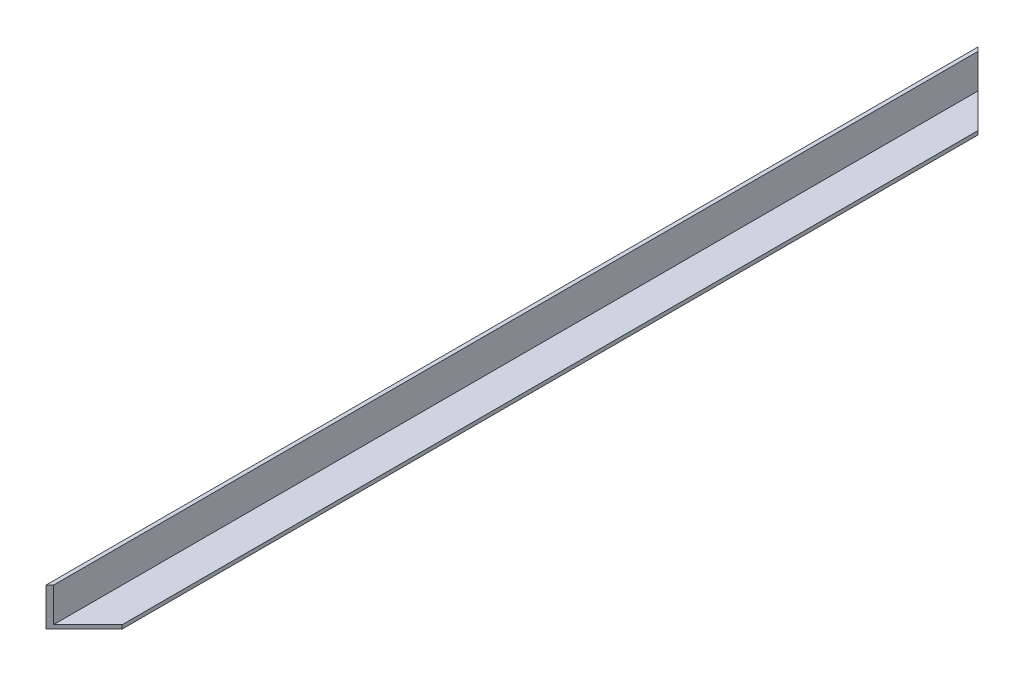
ISO-10303-21;
HEADER;
FILE_DESCRIPTION(('STEP AP214'),'2;1');
FILE_NAME('part.step','',(''),(''),'','','');
FILE_SCHEMA(('AUTOMOTIVE_DESIGN { 1 0 10303 214 1 1 1 1 }'));
ENDSEC;
DATA;
#1=APPLICATION_CONTEXT('core data for automotive mechanical design processes');
#2=APPLICATION_PROTOCOL_DEFINITION('international standard','automotive_design',2000,#1);
#3=PRODUCT_CONTEXT('',#1,'mechanical');
#4=PRODUCT('Part','Part','',(#3));
#5=PRODUCT_RELATED_PRODUCT_CATEGORY('part','',(#4));
#6=PRODUCT_DEFINITION_FORMATION('','',#4);
#7=PRODUCT_DEFINITION_CONTEXT('part definition',#1,'design');
#8=PRODUCT_DEFINITION('design','',#6,#7);
#9=PRODUCT_DEFINITION_SHAPE('','',#8);
#10=(LENGTH_UNIT() NAMED_UNIT(*) SI_UNIT(.MILLI.,.METRE.));
#11=(NAMED_UNIT(*) PLANE_ANGLE_UNIT() SI_UNIT($,.RADIAN.));
#12=(NAMED_UNIT(*) SI_UNIT($,.STERADIAN.) SOLID_ANGLE_UNIT());
#13=UNCERTAINTY_MEASURE_WITH_UNIT(LENGTH_MEASURE(1.E-05),#10,'distance_accuracy_value','');
#14=(GEOMETRIC_REPRESENTATION_CONTEXT(3) GLOBAL_UNCERTAINTY_ASSIGNED_CONTEXT((#13)) GLOBAL_UNIT_ASSIGNED_CONTEXT((#10,
#11,#12)) REPRESENTATION_CONTEXT('',''));
#15=CARTESIAN_POINT('',(0.,0.,0.));
#16=DIRECTION('',(0.,0.,1.));
#17=DIRECTION('',(1.,0.,0.));
#18=AXIS2_PLACEMENT_3D('',#15,#16,#17);
#19=CARTESIAN_POINT('',(2.,20.,489.));
#20=DIRECTION('',(0.,-1.,0.));
#21=DIRECTION('',(0.,0.,-1.));
#22=AXIS2_PLACEMENT_3D('',#19,#20,#21);
#23=PLANE('',#22);
#24=DIRECTION('',(0.,0.,-1.));
#25=VECTOR('',#24,1.);
#26=CARTESIAN_POINT('',(2.,20.,489.));
#27=LINE('',#26,#25);
#28=CARTESIAN_POINT('',(2.00000000000001,20.,487.));
#29=VERTEX_POINT('',#28);
#30=CARTESIAN_POINT('',(1.99999999999999,20.,1.99999999999994));
#31=VERTEX_POINT('',#30);
#32=EDGE_CURVE('E100',#29,#31,#27,.T.);
#33=ORIENTED_EDGE('',*,*,#32,.T.);
#34=DIRECTION('',(0.707106781186555,0.,0.70710678118654));
#35=VECTOR('',#34,1.);
#36=CARTESIAN_POINT('',(0.,20.,0.));
#37=LINE('',#36,#35);
#38=CARTESIAN_POINT('',(0.,20.,0.));
#39=VERTEX_POINT('',#38);
#40=EDGE_CURVE('E86',#39,#31,#37,.T.);
#41=ORIENTED_EDGE('',*,*,#40,.F.);
#42=DIRECTION('',(0.,0.,-1.));
#43=VECTOR('',#42,1.);
#44=CARTESIAN_POINT('',(0.,20.,489.));
#45=LINE('',#44,#43);
#46=CARTESIAN_POINT('',(0.,20.,489.));
#47=VERTEX_POINT('',#46);
#48=EDGE_CURVE('E11',#47,#39,#45,.T.);
#49=ORIENTED_EDGE('',*,*,#48,.F.);
#50=DIRECTION('',(0.707106781186551,0.,-0.707106781186544));
#51=VECTOR('',#50,1.);
#52=CARTESIAN_POINT('',(244.5,20.,244.500000000003));
#53=LINE('',#52,#51);
#54=EDGE_CURVE('E50',#47,#29,#53,.T.);
#55=ORIENTED_EDGE('',*,*,#54,.T.);
#56=EDGE_LOOP('',(#33,#41,#49,#55));
#57=FACE_BOUND('',#56,.T.);
#58=ADVANCED_FACE('F36',(#57),#23,.F.);
#59=CARTESIAN_POINT('',(0.,0.,489.));
#60=DIRECTION('',(0.,1.,0.));
#61=DIRECTION('',(0.,0.,1.));
#62=AXIS2_PLACEMENT_3D('',#59,#60,#61);
#63=PLANE('',#62);
#64=DIRECTION('',(0.,0.,-1.));
#65=VECTOR('',#64,1.);
#66=CARTESIAN_POINT('',(0.,0.,489.));
#67=LINE('',#66,#65);
#68=CARTESIAN_POINT('',(0.,0.,489.));
#69=VERTEX_POINT('',#68);
#70=CARTESIAN_POINT('',(0.,0.,0.));
#71=VERTEX_POINT('',#70);
#72=EDGE_CURVE('E44',#69,#71,#67,.T.);
#73=ORIENTED_EDGE('',*,*,#72,.T.);
#74=DIRECTION('',(0.707106781186555,0.,0.70710678118654));
#75=VECTOR('',#74,1.);
#76=CARTESIAN_POINT('',(244.5,0.,244.499999999995));
#77=LINE('',#76,#75);
#78=CARTESIAN_POINT('',(20.,0.,19.9999999999996));
#79=VERTEX_POINT('',#78);
#80=EDGE_CURVE('E89',#71,#79,#77,.T.);
#81=ORIENTED_EDGE('',*,*,#80,.T.);
#82=DIRECTION('',(0.,0.,-1.));
#83=VECTOR('',#82,1.);
#84=CARTESIAN_POINT('',(20.,0.,489.));
#85=LINE('',#84,#83);
#86=CARTESIAN_POINT('',(20.,0.,469.));
#87=VERTEX_POINT('',#86);
#88=EDGE_CURVE('E117',#87,#79,#85,.T.);
#89=ORIENTED_EDGE('',*,*,#88,.F.);
#90=DIRECTION('',(0.707106781186551,0.,-0.707106781186544));
#91=VECTOR('',#90,1.);
#92=CARTESIAN_POINT('',(0.,0.,489.));
#93=LINE('',#92,#91);
#94=EDGE_CURVE('E94',#69,#87,#93,.T.);
#95=ORIENTED_EDGE('',*,*,#94,.F.);
#96=EDGE_LOOP('',(#73,#81,#89,#95));
#97=FACE_BOUND('',#96,.T.);
#98=ADVANCED_FACE('F120',(#97),#63,.F.);
#99=CARTESIAN_POINT('',(20.,0.,489.));
#100=DIRECTION('',(-1.,0.,0.));
#101=DIRECTION('',(0.,0.,1.));
#102=AXIS2_PLACEMENT_3D('',#99,#100,#101);
#103=PLANE('',#102);
#104=ORIENTED_EDGE('',*,*,#88,.T.);
#105=DIRECTION('',(0.,1.,0.));
#106=VECTOR('',#105,1.);
#107=CARTESIAN_POINT('',(20.,-465.,19.9999999999996));
#108=LINE('',#107,#106);
#109=CARTESIAN_POINT('',(20.,2.,19.9999999999996));
#110=VERTEX_POINT('',#109);
#111=EDGE_CURVE('E101',#79,#110,#108,.T.);
#112=ORIENTED_EDGE('',*,*,#111,.T.);
#113=DIRECTION('',(0.,0.,-1.));
#114=VECTOR('',#113,1.);
#115=CARTESIAN_POINT('',(20.,2.,489.));
#116=LINE('',#115,#114);
#117=CARTESIAN_POINT('',(20.,2.,469.));
#118=VERTEX_POINT('',#117);
#119=EDGE_CURVE('E114',#118,#110,#116,.T.);
#120=ORIENTED_EDGE('',*,*,#119,.F.);
#121=DIRECTION('',(0.,1.,0.));
#122=VECTOR('',#121,1.);
#123=CARTESIAN_POINT('',(20.,-465.,469.));
#124=LINE('',#123,#122);
#125=EDGE_CURVE('E102',#87,#118,#124,.T.);
#126=ORIENTED_EDGE('',*,*,#125,.F.);
#127=EDGE_LOOP('',(#104,#112,#120,#126));
#128=FACE_BOUND('',#127,.T.);
#129=ADVANCED_FACE('F140',(#128),#103,.F.);
#130=CARTESIAN_POINT('',(20.,2.,489.));
#131=DIRECTION('',(0.,-1.,0.));
#132=DIRECTION('',(1.,0.,0.));
#133=AXIS2_PLACEMENT_3D('',#130,#131,#132);
#134=PLANE('',#133);
#135=ORIENTED_EDGE('',*,*,#119,.T.);
#136=DIRECTION('',(-0.707106781186555,0.,-0.70710678118654));
#137=VECTOR('',#136,1.);
#138=CARTESIAN_POINT('',(254.5,2.00000000000003,254.499999999995));
#139=LINE('',#138,#137);
#140=CARTESIAN_POINT('',(2.,2.,2.));
#141=VERTEX_POINT('',#140);
#142=EDGE_CURVE('E130',#110,#141,#139,.T.);
#143=ORIENTED_EDGE('',*,*,#142,.T.);
#144=DIRECTION('',(0.,0.,-1.));
#145=VECTOR('',#144,1.);
#146=CARTESIAN_POINT('',(2.,2.,489.));
#147=LINE('',#146,#145);
#148=CARTESIAN_POINT('',(2.,2.,487.));
#149=VERTEX_POINT('',#148);
#150=EDGE_CURVE('E107',#149,#141,#147,.T.);
#151=ORIENTED_EDGE('',*,*,#150,.F.);
#152=DIRECTION('',(-0.707106781186551,0.,0.707106781186544));
#153=VECTOR('',#152,1.);
#154=CARTESIAN_POINT('',(10.0000000000001,2.,479.));
#155=LINE('',#154,#153);
#156=EDGE_CURVE('E123',#118,#149,#155,.T.);
#157=ORIENTED_EDGE('',*,*,#156,.F.);
#158=EDGE_LOOP('',(#135,#143,#151,#157));
#159=FACE_BOUND('',#158,.T.);
#160=ADVANCED_FACE('F142',(#159),#134,.F.);
#161=CARTESIAN_POINT('',(2.,2.,489.));
#162=DIRECTION('',(-1.,0.,0.));
#163=DIRECTION('',(0.,-1.,0.));
#164=AXIS2_PLACEMENT_3D('',#161,#162,#163);
#165=PLANE('',#164);
#166=ORIENTED_EDGE('',*,*,#150,.T.);
#167=DIRECTION('',(0.,1.,0.));
#168=VECTOR('',#167,1.);
#169=CARTESIAN_POINT('',(2.,2.00000000000004,2.));
#170=LINE('',#169,#168);
#171=EDGE_CURVE('E133',#141,#31,#170,.T.);
#172=ORIENTED_EDGE('',*,*,#171,.T.);
#173=ORIENTED_EDGE('',*,*,#32,.F.);
#174=DIRECTION('',(0.,1.,0.));
#175=VECTOR('',#174,1.);
#176=CARTESIAN_POINT('',(2.,2.,487.));
#177=LINE('',#176,#175);
#178=EDGE_CURVE('E124',#149,#29,#177,.T.);
#179=ORIENTED_EDGE('',*,*,#178,.F.);
#180=EDGE_LOOP('',(#166,#172,#173,#179));
#181=FACE_BOUND('',#180,.T.);
#182=ADVANCED_FACE('F145',(#181),#165,.F.);
#183=CARTESIAN_POINT('',(0.,20.,489.));
#184=DIRECTION('',(1.,0.,0.));
#185=DIRECTION('',(0.,1.,0.));
#186=AXIS2_PLACEMENT_3D('',#183,#184,#185);
#187=PLANE('',#186);
#188=DIRECTION('',(0.,-1.,0.));
#189=VECTOR('',#188,1.);
#190=CARTESIAN_POINT('',(0.,20.,0.));
#191=LINE('',#190,#189);
#192=EDGE_CURVE('E83',#39,#71,#191,.T.);
#193=ORIENTED_EDGE('',*,*,#192,.T.);
#194=ORIENTED_EDGE('',*,*,#72,.F.);
#195=DIRECTION('',(0.,-1.,0.));
#196=VECTOR('',#195,1.);
#197=CARTESIAN_POINT('',(0.,20.,489.));
#198=LINE('',#197,#196);
#199=EDGE_CURVE('E93',#47,#69,#198,.T.);
#200=ORIENTED_EDGE('',*,*,#199,.F.);
#201=ORIENTED_EDGE('',*,*,#48,.T.);
#202=EDGE_LOOP('',(#193,#194,#200,#201));
#203=FACE_BOUND('',#202,.T.);
#204=ADVANCED_FACE('F104',(#203),#187,.F.);
#205=CARTESIAN_POINT('',(0.,-465.,0.));
#206=DIRECTION('',(-0.70710678118654,0.,0.707106781186555));
#207=DIRECTION('',(0.707106781186555,0.,0.70710678118654));
#208=AXIS2_PLACEMENT_3D('',#205,#206,#207);
#209=PLANE('',#208);
#210=ORIENTED_EDGE('',*,*,#192,.F.);
#211=ORIENTED_EDGE('',*,*,#40,.T.);
#212=ORIENTED_EDGE('',*,*,#171,.F.);
#213=ORIENTED_EDGE('',*,*,#142,.F.);
#214=ORIENTED_EDGE('',*,*,#111,.F.);
#215=ORIENTED_EDGE('',*,*,#80,.F.);
#216=EDGE_LOOP('',(#210,#211,#212,#213,#214,#215));
#217=FACE_BOUND('',#216,.T.);
#218=ADVANCED_FACE('F85',(#217),#209,.F.);
#219=CARTESIAN_POINT('',(244.5,-465.,244.500000000003));
#220=DIRECTION('',(0.707106781186544,0.,0.707106781186551));
#221=DIRECTION('',(0.707106781186551,0.,-0.707106781186544));
#222=AXIS2_PLACEMENT_3D('',#219,#220,#221);
#223=PLANE('',#222);
#224=ORIENTED_EDGE('',*,*,#94,.T.);
#225=ORIENTED_EDGE('',*,*,#125,.T.);
#226=ORIENTED_EDGE('',*,*,#156,.T.);
#227=ORIENTED_EDGE('',*,*,#178,.T.);
#228=ORIENTED_EDGE('',*,*,#54,.F.);
#229=ORIENTED_EDGE('',*,*,#199,.T.);
#230=EDGE_LOOP('',(#224,#225,#226,#227,#228,#229));
#231=FACE_BOUND('',#230,.T.);
#232=ADVANCED_FACE('F146',(#231),#223,.T.);
#233=CLOSED_SHELL('',(#58,#98,#129,#160,#182,#204,#218,#232));
#234=MANIFOLD_SOLID_BREP('B2',#233);
#235=ADVANCED_BREP_SHAPE_REPRESENTATION('',(#18,#234),#14);
#236=SHAPE_DEFINITION_REPRESENTATION(#9,#235);
ENDSEC;
END-ISO-10303-21;
